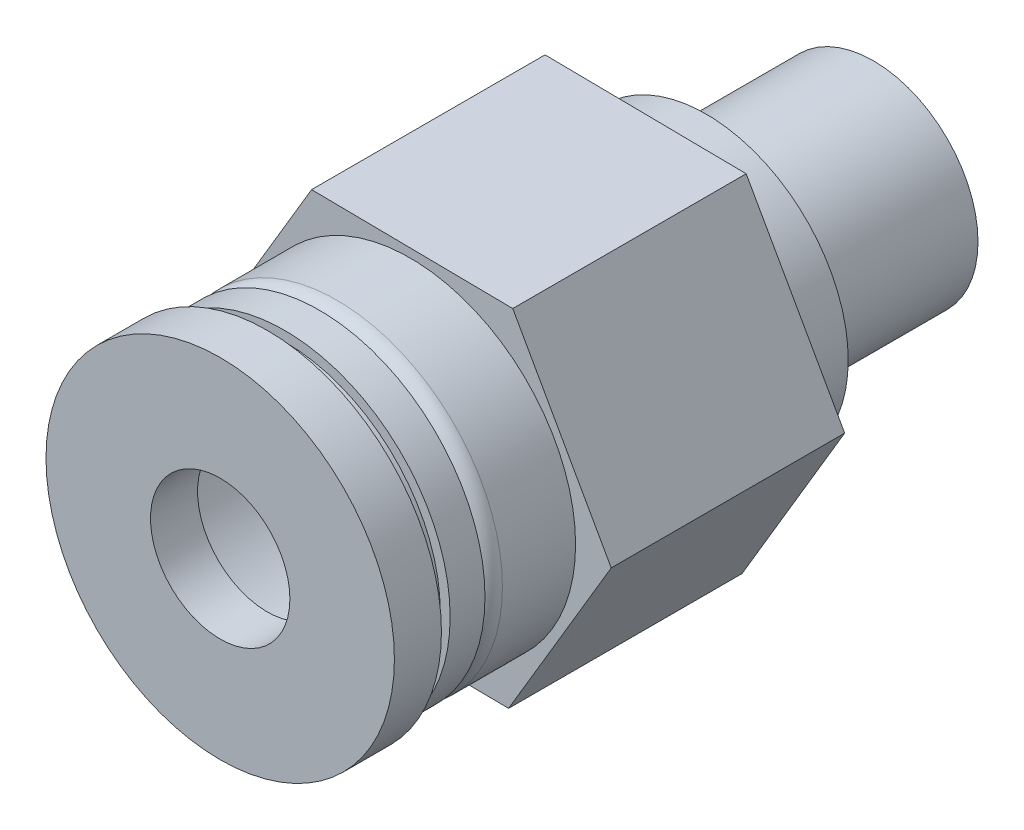
ISO-10303-21;
HEADER;
FILE_DESCRIPTION(('STEP AP214'),'2;1');
FILE_NAME('part.step','',(''),(''),'','','');
FILE_SCHEMA(('AUTOMOTIVE_DESIGN { 1 0 10303 214 1 1 1 1 }'));
ENDSEC;
DATA;
#1=APPLICATION_CONTEXT('core data for automotive mechanical design processes');
#2=APPLICATION_PROTOCOL_DEFINITION('international standard','automotive_design',2000,#1);
#3=PRODUCT_CONTEXT('',#1,'mechanical');
#4=PRODUCT('Part','Part','',(#3));
#5=PRODUCT_RELATED_PRODUCT_CATEGORY('part','',(#4));
#6=PRODUCT_DEFINITION_FORMATION('','',#4);
#7=PRODUCT_DEFINITION_CONTEXT('part definition',#1,'design');
#8=PRODUCT_DEFINITION('design','',#6,#7);
#9=PRODUCT_DEFINITION_SHAPE('','',#8);
#10=(LENGTH_UNIT() NAMED_UNIT(*) SI_UNIT(.MILLI.,.METRE.));
#11=(NAMED_UNIT(*) PLANE_ANGLE_UNIT() SI_UNIT($,.RADIAN.));
#12=(NAMED_UNIT(*) SI_UNIT($,.STERADIAN.) SOLID_ANGLE_UNIT());
#13=UNCERTAINTY_MEASURE_WITH_UNIT(LENGTH_MEASURE(1.E-05),#10,'distance_accuracy_value','');
#14=(GEOMETRIC_REPRESENTATION_CONTEXT(3) GLOBAL_UNCERTAINTY_ASSIGNED_CONTEXT((#13)) GLOBAL_UNIT_ASSIGNED_CONTEXT((#10,
#11,#12)) REPRESENTATION_CONTEXT('',''));
#15=CARTESIAN_POINT('',(0.,0.,0.));
#16=DIRECTION('',(0.,0.,1.));
#17=DIRECTION('',(1.,0.,0.));
#18=AXIS2_PLACEMENT_3D('',#15,#16,#17);
#19=CARTESIAN_POINT('',(0.,0.,17.));
#20=DIRECTION('',(0.,0.,1.));
#21=DIRECTION('',(1.,0.,0.));
#22=AXIS2_PLACEMENT_3D('',#19,#20,#21);
#23=PLANE('',#22);
#24=CARTESIAN_POINT('',(0.,0.,17.));
#25=DIRECTION('',(0.,0.,1.));
#26=DIRECTION('',(1.,0.,0.));
#27=AXIS2_PLACEMENT_3D('',#24,#25,#26);
#28=CIRCLE('',#27,4.46573097871401);
#29=CARTESIAN_POINT('',(4.46573097871401,0.,17.));
#30=VERTEX_POINT('',#29);
#31=EDGE_CURVE('E52',#30,#30,#28,.T.);
#32=ORIENTED_EDGE('',*,*,#31,.F.);
#33=EDGE_LOOP('',(#32));
#34=FACE_BOUND('',#33,.T.);
#35=CARTESIAN_POINT('',(0.,0.,17.));
#36=DIRECTION('',(0.,0.,1.));
#37=DIRECTION('',(1.,0.,0.));
#38=AXIS2_PLACEMENT_3D('',#35,#36,#37);
#39=CIRCLE('',#38,4.17701490620842);
#40=CARTESIAN_POINT('',(4.17701490620842,0.,17.));
#41=VERTEX_POINT('',#40);
#42=EDGE_CURVE('E59',#41,#41,#39,.T.);
#43=ORIENTED_EDGE('',*,*,#42,.T.);
#44=EDGE_LOOP('',(#43));
#45=FACE_BOUND('',#44,.T.);
#46=ADVANCED_FACE('F48',(#34,#45),#23,.F.);
#47=CARTESIAN_POINT('',(0.,0.,17.5));
#48=DIRECTION('',(0.,0.,-1.));
#49=DIRECTION('',(-1.,0.,0.));
#50=AXIS2_PLACEMENT_3D('',#47,#48,#49);
#51=CYLINDRICAL_SURFACE('',#50,4.46573097871401);
#52=CARTESIAN_POINT('',(0.,0.,17.5));
#53=DIRECTION('',(0.,0.,1.));
#54=DIRECTION('',(1.,0.,0.));
#55=AXIS2_PLACEMENT_3D('',#52,#53,#54);
#56=CIRCLE('',#55,4.46573097871401);
#57=CARTESIAN_POINT('',(4.46573097871401,0.,17.5));
#58=VERTEX_POINT('',#57);
#59=EDGE_CURVE('E11',#58,#58,#56,.T.);
#60=ORIENTED_EDGE('',*,*,#59,.F.);
#61=EDGE_LOOP('',(#60));
#62=FACE_BOUND('',#61,.T.);
#63=ORIENTED_EDGE('',*,*,#31,.T.);
#64=EDGE_LOOP('',(#63));
#65=FACE_BOUND('',#64,.T.);
#66=ADVANCED_FACE('F50',(#62,#65),#51,.T.);
#67=CARTESIAN_POINT('',(0.,0.,17.5));
#68=DIRECTION('',(0.,0.,-1.));
#69=DIRECTION('',(-1.,0.,0.));
#70=AXIS2_PLACEMENT_3D('',#67,#68,#69);
#71=CYLINDRICAL_SURFACE('',#70,4.17701490620842);
#72=CARTESIAN_POINT('',(0.,0.,17.5));
#73=DIRECTION('',(0.,0.,1.));
#74=DIRECTION('',(1.,0.,0.));
#75=AXIS2_PLACEMENT_3D('',#72,#73,#74);
#76=CIRCLE('',#75,4.17701490620842);
#77=CARTESIAN_POINT('',(4.17701490620842,0.,17.5));
#78=VERTEX_POINT('',#77);
#79=EDGE_CURVE('E63',#78,#78,#76,.T.);
#80=ORIENTED_EDGE('',*,*,#79,.T.);
#81=EDGE_LOOP('',(#80));
#82=FACE_BOUND('',#81,.T.);
#83=ORIENTED_EDGE('',*,*,#42,.F.);
#84=EDGE_LOOP('',(#83));
#85=FACE_BOUND('',#84,.T.);
#86=ADVANCED_FACE('F95',(#82,#85),#71,.F.);
#87=CARTESIAN_POINT('',(0.,0.,17.5));
#88=DIRECTION('',(0.,0.,1.));
#89=DIRECTION('',(1.,0.,0.));
#90=AXIS2_PLACEMENT_3D('',#87,#88,#89);
#91=PLANE('',#90);
#92=CARTESIAN_POINT('',(0.,0.,17.5));
#93=DIRECTION('',(0.,0.,1.));
#94=DIRECTION('',(1.,0.,0.));
#95=AXIS2_PLACEMENT_3D('',#92,#93,#94);
#96=CIRCLE('',#95,5.);
#97=CARTESIAN_POINT('',(5.,0.,17.5));
#98=VERTEX_POINT('',#97);
#99=EDGE_CURVE('E67',#98,#98,#96,.T.);
#100=ORIENTED_EDGE('',*,*,#99,.F.);
#101=EDGE_LOOP('',(#100));
#102=FACE_BOUND('',#101,.T.);
#103=ORIENTED_EDGE('',*,*,#59,.T.);
#104=EDGE_LOOP('',(#103));
#105=FACE_BOUND('',#104,.T.);
#106=ADVANCED_FACE('F85',(#102,#105),#91,.F.);
#107=CARTESIAN_POINT('',(0.,0.,18.85));
#108=DIRECTION('',(0.,0.,1.));
#109=DIRECTION('',(1.,0.,0.));
#110=AXIS2_PLACEMENT_3D('',#107,#108,#109);
#111=PLANE('',#110);
#112=CARTESIAN_POINT('',(0.,0.,18.85));
#113=DIRECTION('',(0.,0.,1.));
#114=DIRECTION('',(1.,0.,0.));
#115=AXIS2_PLACEMENT_3D('',#112,#113,#114);
#116=CIRCLE('',#115,5.);
#117=CARTESIAN_POINT('',(5.,0.,18.85));
#118=VERTEX_POINT('',#117);
#119=EDGE_CURVE('E66',#118,#118,#116,.T.);
#120=ORIENTED_EDGE('',*,*,#119,.T.);
#121=EDGE_LOOP('',(#120));
#122=FACE_BOUND('',#121,.T.);
#123=CARTESIAN_POINT('',(0.,0.,18.85));
#124=DIRECTION('',(0.,0.,1.));
#125=DIRECTION('',(1.,0.,0.));
#126=AXIS2_PLACEMENT_3D('',#123,#124,#125);
#127=CIRCLE('',#126,2.);
#128=CARTESIAN_POINT('',(2.,0.,18.85));
#129=VERTEX_POINT('',#128);
#130=EDGE_CURVE('E70',#129,#129,#127,.T.);
#131=ORIENTED_EDGE('',*,*,#130,.F.);
#132=EDGE_LOOP('',(#131));
#133=FACE_BOUND('',#132,.T.);
#134=ADVANCED_FACE('F82',(#122,#133),#111,.T.);
#135=ORIENTED_EDGE('',*,*,#79,.F.);
#136=EDGE_LOOP('',(#135));
#137=FACE_BOUND('',#136,.T.);
#138=CARTESIAN_POINT('',(0.,0.,17.5));
#139=DIRECTION('',(0.,0.,1.));
#140=DIRECTION('',(1.,0.,0.));
#141=AXIS2_PLACEMENT_3D('',#138,#139,#140);
#142=CIRCLE('',#141,2.);
#143=CARTESIAN_POINT('',(2.,0.,17.5));
#144=VERTEX_POINT('',#143);
#145=EDGE_CURVE('E73',#144,#144,#142,.T.);
#146=ORIENTED_EDGE('',*,*,#145,.T.);
#147=EDGE_LOOP('',(#146));
#148=FACE_BOUND('',#147,.T.);
#149=ADVANCED_FACE('F84',(#137,#148),#91,.F.);
#150=CARTESIAN_POINT('',(0.,0.,18.85));
#151=DIRECTION('',(0.,0.,-1.));
#152=DIRECTION('',(-1.,0.,0.));
#153=AXIS2_PLACEMENT_3D('',#150,#151,#152);
#154=CYLINDRICAL_SURFACE('',#153,5.);
#155=ORIENTED_EDGE('',*,*,#119,.F.);
#156=EDGE_LOOP('',(#155));
#157=FACE_BOUND('',#156,.T.);
#158=ORIENTED_EDGE('',*,*,#99,.T.);
#159=EDGE_LOOP('',(#158));
#160=FACE_BOUND('',#159,.T.);
#161=ADVANCED_FACE('F92',(#157,#160),#154,.T.);
#162=CARTESIAN_POINT('',(0.,0.,18.85));
#163=DIRECTION('',(0.,0.,-1.));
#164=DIRECTION('',(-1.,0.,0.));
#165=AXIS2_PLACEMENT_3D('',#162,#163,#164);
#166=CYLINDRICAL_SURFACE('',#165,2.);
#167=ORIENTED_EDGE('',*,*,#130,.T.);
#168=EDGE_LOOP('',(#167));
#169=FACE_BOUND('',#168,.T.);
#170=ORIENTED_EDGE('',*,*,#145,.F.);
#171=EDGE_LOOP('',(#170));
#172=FACE_BOUND('',#171,.T.);
#173=ADVANCED_FACE('F79',(#169,#172),#166,.F.);
#174=CLOSED_SHELL('',(#46,#66,#86,#106,#134,#149,#161,#173));
#175=MANIFOLD_SOLID_BREP('B2',#174);
#176=CARTESIAN_POINT('',(0.,0.,6.7));
#177=DIRECTION('',(0.,0.,1.));
#178=DIRECTION('',(1.,0.,0.));
#179=AXIS2_PLACEMENT_3D('',#176,#177,#178);
#180=PLANE('',#179);
#181=CARTESIAN_POINT('',(0.,0.,6.7));
#182=DIRECTION('',(0.,0.,1.));
#183=DIRECTION('',(1.,0.,0.));
#184=AXIS2_PLACEMENT_3D('',#181,#182,#183);
#185=CIRCLE('',#184,2.15);
#186=CARTESIAN_POINT('',(2.15,0.,6.7));
#187=VERTEX_POINT('',#186);
#188=EDGE_CURVE('E297',#187,#187,#185,.T.);
#189=ORIENTED_EDGE('',*,*,#188,.F.);
#190=EDGE_LOOP('',(#189));
#191=FACE_BOUND('',#190,.T.);
#192=CARTESIAN_POINT('',(0.,0.,6.7));
#193=DIRECTION('',(0.,0.,1.));
#194=DIRECTION('',(1.,0.,0.));
#195=AXIS2_PLACEMENT_3D('',#192,#193,#194);
#196=CIRCLE('',#195,3.);
#197=CARTESIAN_POINT('',(3.,0.,6.7));
#198=VERTEX_POINT('',#197);
#199=EDGE_CURVE('E46',#198,#198,#196,.F.);
#200=ORIENTED_EDGE('',*,*,#199,.F.);
#201=EDGE_LOOP('',(#200));
#202=FACE_BOUND('',#201,.T.);
#203=ADVANCED_FACE('F169',(#191,#202),#180,.T.);
#204=CARTESIAN_POINT('',(0.,0.,6.7));
#205=DIRECTION('',(0.,0.,-1.));
#206=DIRECTION('',(-1.,0.,0.));
#207=AXIS2_PLACEMENT_3D('',#204,#205,#206);
#208=CYLINDRICAL_SURFACE('',#207,3.);
#209=CARTESIAN_POINT('',(0.,0.,4.9));
#210=DIRECTION('',(0.,0.,-1.));
#211=DIRECTION('',(-1.,0.,0.));
#212=AXIS2_PLACEMENT_3D('',#209,#210,#211);
#213=CIRCLE('',#212,3.);
#214=CARTESIAN_POINT('',(-3.,0.,4.9));
#215=VERTEX_POINT('',#214);
#216=EDGE_CURVE('E288',#215,#215,#213,.T.);
#217=ORIENTED_EDGE('',*,*,#216,.T.);
#218=EDGE_LOOP('',(#217));
#219=FACE_BOUND('',#218,.T.);
#220=CARTESIAN_POINT('',(0.,0.,0.1));
#221=DIRECTION('',(0.,0.,-1.));
#222=DIRECTION('',(-1.,0.,0.));
#223=AXIS2_PLACEMENT_3D('',#220,#221,#222);
#224=CIRCLE('',#223,3.);
#225=CARTESIAN_POINT('',(-3.,0.,0.1));
#226=VERTEX_POINT('',#225);
#227=EDGE_CURVE('E178',#226,#226,#224,.T.);
#228=ORIENTED_EDGE('',*,*,#227,.F.);
#229=EDGE_LOOP('',(#228));
#230=FACE_BOUND('',#229,.T.);
#231=ADVANCED_FACE('F171',(#219,#230),#208,.T.);
#232=CARTESIAN_POINT('',(0.,0.,0.1));
#233=DIRECTION('',(0.,0.,-1.));
#234=DIRECTION('',(-1.,0.,0.));
#235=AXIS2_PLACEMENT_3D('',#232,#233,#234);
#236=PLANE('',#235);
#237=CARTESIAN_POINT('',(0.,0.,0.1));
#238=DIRECTION('',(0.,0.,-1.));
#239=DIRECTION('',(-1.,0.,0.));
#240=AXIS2_PLACEMENT_3D('',#237,#238,#239);
#241=CIRCLE('',#240,2.15);
#242=CARTESIAN_POINT('',(-2.15,0.,0.1));
#243=VERTEX_POINT('',#242);
#244=EDGE_CURVE('E294',#243,#243,#241,.T.);
#245=ORIENTED_EDGE('',*,*,#244,.F.);
#246=EDGE_LOOP('',(#245));
#247=FACE_BOUND('',#246,.T.);
#248=ORIENTED_EDGE('',*,*,#227,.T.);
#249=EDGE_LOOP('',(#248));
#250=FACE_BOUND('',#249,.T.);
#251=ADVANCED_FACE('F302',(#247,#250),#236,.T.);
#252=CARTESIAN_POINT('',(0.,0.,12.7));
#253=DIRECTION('',(0.,0.,-1.));
#254=DIRECTION('',(-1.,0.,0.));
#255=AXIS2_PLACEMENT_3D('',#252,#253,#254);
#256=CYLINDRICAL_SURFACE('',#255,2.15);
#257=ORIENTED_EDGE('',*,*,#188,.T.);
#258=EDGE_LOOP('',(#257));
#259=FACE_BOUND('',#258,.T.);
#260=ORIENTED_EDGE('',*,*,#244,.T.);
#261=EDGE_LOOP('',(#260));
#262=FACE_BOUND('',#261,.T.);
#263=ADVANCED_FACE('F310',(#259,#262),#256,.F.);
#264=CARTESIAN_POINT('',(0.,0.,4.9));
#265=DIRECTION('',(0.,0.,-1.));
#266=DIRECTION('',(-1.,0.,0.));
#267=AXIS2_PLACEMENT_3D('',#264,#265,#266);
#268=PLANE('',#267);
#269=CARTESIAN_POINT('',(0.,0.,4.9));
#270=DIRECTION('',(0.,0.,-1.));
#271=DIRECTION('',(-1.,0.,0.));
#272=AXIS2_PLACEMENT_3D('',#269,#270,#271);
#273=CIRCLE('',#272,4.075);
#274=CARTESIAN_POINT('',(-4.075,0.,4.9));
#275=VERTEX_POINT('',#274);
#276=EDGE_CURVE('E291',#275,#275,#273,.T.);
#277=ORIENTED_EDGE('',*,*,#276,.T.);
#278=EDGE_LOOP('',(#277));
#279=FACE_BOUND('',#278,.T.);
#280=ORIENTED_EDGE('',*,*,#216,.F.);
#281=EDGE_LOOP('',(#280));
#282=FACE_BOUND('',#281,.T.);
#283=ADVANCED_FACE('F317',(#279,#282),#268,.T.);
#284=CARTESIAN_POINT('',(0.,0.,4.9));
#285=DIRECTION('',(0.,0.,1.));
#286=DIRECTION('',(1.,0.,0.));
#287=AXIS2_PLACEMENT_3D('',#284,#285,#286);
#288=CYLINDRICAL_SURFACE('',#287,4.075);
#289=ORIENTED_EDGE('',*,*,#276,.F.);
#290=EDGE_LOOP('',(#289));
#291=FACE_BOUND('',#290,.T.);
#292=CARTESIAN_POINT('',(0.,0.,6.7));
#293=DIRECTION('',(0.,0.,1.));
#294=DIRECTION('',(1.,0.,0.));
#295=AXIS2_PLACEMENT_3D('',#292,#293,#294);
#296=CIRCLE('',#295,4.075);
#297=CARTESIAN_POINT('',(4.075,0.,6.7));
#298=VERTEX_POINT('',#297);
#299=EDGE_CURVE('E285',#298,#298,#296,.T.);
#300=ORIENTED_EDGE('',*,*,#299,.F.);
#301=EDGE_LOOP('',(#300));
#302=FACE_BOUND('',#301,.T.);
#303=ADVANCED_FACE('F319',(#291,#302),#288,.T.);
#304=CARTESIAN_POINT('',(0.,0.,13.4));
#305=DIRECTION('',(0.,0.,1.));
#306=DIRECTION('',(1.,0.,0.));
#307=AXIS2_PLACEMENT_3D('',#304,#305,#306);
#308=PLANE('',#307);
#309=DIRECTION('',(0.999928814042504,-0.0119317579405014,0.));
#310=VECTOR('',#309,1.);
#311=CARTESIAN_POINT('',(-2.94620463949202,-4.96520005191825,13.4));
#312=LINE('',#311,#310);
#313=CARTESIAN_POINT('',(-2.94620463949202,-4.96520005191825,13.4));
#314=VERTEX_POINT('',#313);
#315=CARTESIAN_POINT('',(2.82688706008701,-5.03408808850679,13.4));
#316=VERTEX_POINT('',#315);
#317=EDGE_CURVE('E267',#314,#316,#312,.T.);
#318=ORIENTED_EDGE('',*,*,#317,.T.);
#319=DIRECTION('',(0.510297612509533,0.859997875966604,0.));
#320=VECTOR('',#319,1.);
#321=CARTESIAN_POINT('',(2.82688706008701,-5.03408808850679,13.4));
#322=LINE('',#321,#320);
#323=CARTESIAN_POINT('',(5.77309169957903,-0.0688880365885399,13.4));
#324=VERTEX_POINT('',#323);
#325=EDGE_CURVE('E224',#316,#324,#322,.T.);
#326=ORIENTED_EDGE('',*,*,#325,.T.);
#327=DIRECTION('',(-0.489631201532972,0.871929633907105,0.));
#328=VECTOR('',#327,1.);
#329=CARTESIAN_POINT('',(5.77309169957903,-0.0688880365885399,13.4));
#330=LINE('',#329,#328);
#331=CARTESIAN_POINT('',(2.94620463949202,4.96520005191825,13.4));
#332=VERTEX_POINT('',#331);
#333=EDGE_CURVE('E238',#324,#332,#330,.T.);
#334=ORIENTED_EDGE('',*,*,#333,.T.);
#335=DIRECTION('',(-0.999928814042504,0.0119317579405012,0.));
#336=VECTOR('',#335,1.);
#337=CARTESIAN_POINT('',(2.94620463949202,4.96520005191825,13.4));
#338=LINE('',#337,#336);
#339=CARTESIAN_POINT('',(-2.82688706008701,5.03408808850679,13.4));
#340=VERTEX_POINT('',#339);
#341=EDGE_CURVE('E231',#332,#340,#338,.T.);
#342=ORIENTED_EDGE('',*,*,#341,.T.);
#343=DIRECTION('',(-0.510297612509533,-0.859997875966604,0.));
#344=VECTOR('',#343,1.);
#345=CARTESIAN_POINT('',(-2.82688706008701,5.03408808850679,13.4));
#346=LINE('',#345,#344);
#347=CARTESIAN_POINT('',(-5.77309169957903,0.0688880365885399,13.4));
#348=VERTEX_POINT('',#347);
#349=EDGE_CURVE('E236',#340,#348,#346,.T.);
#350=ORIENTED_EDGE('',*,*,#349,.T.);
#351=DIRECTION('',(0.489631201532971,-0.871929633907105,0.));
#352=VECTOR('',#351,1.);
#353=CARTESIAN_POINT('',(-5.77309169957903,0.0688880365885399,13.4));
#354=LINE('',#353,#352);
#355=EDGE_CURVE('E186',#348,#314,#354,.T.);
#356=ORIENTED_EDGE('',*,*,#355,.T.);
#357=EDGE_LOOP('',(#318,#326,#334,#342,#350,#356));
#358=FACE_BOUND('',#357,.T.);
#359=CARTESIAN_POINT('',(0.,0.,13.4));
#360=DIRECTION('',(0.,0.,1.));
#361=DIRECTION('',(1.,0.,0.));
#362=AXIS2_PLACEMENT_3D('',#359,#360,#361);
#363=CIRCLE('',#362,4.75);
#364=CARTESIAN_POINT('',(4.75,0.,13.4));
#365=VERTEX_POINT('',#364);
#366=EDGE_CURVE('E399',#365,#365,#363,.T.);
#367=ORIENTED_EDGE('',*,*,#366,.F.);
#368=EDGE_LOOP('',(#367));
#369=FACE_BOUND('',#368,.T.);
#370=ADVANCED_FACE('F233',(#358,#369),#308,.T.);
#371=CARTESIAN_POINT('',(0.,0.,13.4));
#372=DIRECTION('',(0.,0.,1.));
#373=DIRECTION('',(1.,0.,0.));
#374=AXIS2_PLACEMENT_3D('',#371,#372,#373);
#375=CIRCLE('',#374,3.75);
#376=CARTESIAN_POINT('',(3.75,0.,13.4));
#377=VERTEX_POINT('',#376);
#378=EDGE_CURVE('E276',#377,#377,#375,.F.);
#379=ORIENTED_EDGE('',*,*,#378,.F.);
#380=EDGE_LOOP('',(#379));
#381=FACE_BOUND('',#380,.T.);
#382=CARTESIAN_POINT('',(0.,0.,13.4));
#383=DIRECTION('',(0.,0.,1.));
#384=DIRECTION('',(1.,0.,0.));
#385=AXIS2_PLACEMENT_3D('',#382,#383,#384);
#386=CIRCLE('',#385,3.);
#387=CARTESIAN_POINT('',(3.,0.,13.4));
#388=VERTEX_POINT('',#387);
#389=EDGE_CURVE('E260',#388,#388,#386,.T.);
#390=ORIENTED_EDGE('',*,*,#389,.F.);
#391=EDGE_LOOP('',(#390));
#392=FACE_BOUND('',#391,.T.);
#393=ADVANCED_FACE('F359',(#381,#392),#308,.T.);
#394=CARTESIAN_POINT('',(0.,0.,6.7));
#395=DIRECTION('',(0.,0.,1.));
#396=DIRECTION('',(1.,0.,0.));
#397=AXIS2_PLACEMENT_3D('',#394,#395,#396);
#398=PLANE('',#397);
#399=ORIENTED_EDGE('',*,*,#299,.T.);
#400=EDGE_LOOP('',(#399));
#401=FACE_BOUND('',#400,.T.);
#402=DIRECTION('',(0.999928814042504,-0.0119317579405014,0.));
#403=VECTOR('',#402,1.);
#404=CARTESIAN_POINT('',(-2.94620463949202,-4.96520005191825,6.7));
#405=LINE('',#404,#403);
#406=CARTESIAN_POINT('',(-2.94620463949202,-4.96520005191825,6.7));
#407=VERTEX_POINT('',#406);
#408=CARTESIAN_POINT('',(2.82688706008701,-5.03408808850679,6.7));
#409=VERTEX_POINT('',#408);
#410=EDGE_CURVE('E256',#407,#409,#405,.T.);
#411=ORIENTED_EDGE('',*,*,#410,.F.);
#412=DIRECTION('',(0.489631201532971,-0.871929633907105,0.));
#413=VECTOR('',#412,1.);
#414=CARTESIAN_POINT('',(-5.77309169957903,0.0688880365885399,6.7));
#415=LINE('',#414,#413);
#416=CARTESIAN_POINT('',(-5.77309169957903,0.0688880365885399,6.7));
#417=VERTEX_POINT('',#416);
#418=EDGE_CURVE('E215',#417,#407,#415,.T.);
#419=ORIENTED_EDGE('',*,*,#418,.F.);
#420=DIRECTION('',(-0.510297612509533,-0.859997875966604,0.));
#421=VECTOR('',#420,1.);
#422=CARTESIAN_POINT('',(-2.82688706008701,5.03408808850679,6.7));
#423=LINE('',#422,#421);
#424=CARTESIAN_POINT('',(-2.82688706008701,5.03408808850679,6.7));
#425=VERTEX_POINT('',#424);
#426=EDGE_CURVE('E209',#425,#417,#423,.T.);
#427=ORIENTED_EDGE('',*,*,#426,.F.);
#428=DIRECTION('',(-0.999928814042504,0.0119317579405012,0.));
#429=VECTOR('',#428,1.);
#430=CARTESIAN_POINT('',(2.94620463949202,4.96520005191825,6.7));
#431=LINE('',#430,#429);
#432=CARTESIAN_POINT('',(2.94620463949202,4.96520005191825,6.7));
#433=VERTEX_POINT('',#432);
#434=EDGE_CURVE('E246',#433,#425,#431,.T.);
#435=ORIENTED_EDGE('',*,*,#434,.F.);
#436=DIRECTION('',(-0.489631201532972,0.871929633907105,0.));
#437=VECTOR('',#436,1.);
#438=CARTESIAN_POINT('',(5.77309169957903,-0.0688880365885399,6.7));
#439=LINE('',#438,#437);
#440=CARTESIAN_POINT('',(5.77309169957903,-0.0688880365885399,6.7));
#441=VERTEX_POINT('',#440);
#442=EDGE_CURVE('E262',#441,#433,#439,.T.);
#443=ORIENTED_EDGE('',*,*,#442,.F.);
#444=DIRECTION('',(0.510297612509533,0.859997875966604,0.));
#445=VECTOR('',#444,1.);
#446=CARTESIAN_POINT('',(2.82688706008701,-5.03408808850679,6.7));
#447=LINE('',#446,#445);
#448=EDGE_CURVE('E259',#409,#441,#447,.T.);
#449=ORIENTED_EDGE('',*,*,#448,.F.);
#450=EDGE_LOOP('',(#411,#419,#427,#435,#443,#449));
#451=FACE_BOUND('',#450,.T.);
#452=ADVANCED_FACE('F341',(#401,#451),#398,.F.);
#453=CARTESIAN_POINT('',(-2.94620463949202,-4.96520005191825,13.4));
#454=DIRECTION('',(0.0119317579405014,0.999928814042505,0.));
#455=DIRECTION('',(-0.999928814042504,0.0119317579405013,0.));
#456=AXIS2_PLACEMENT_3D('',#453,#454,#455);
#457=PLANE('',#456);
#458=ORIENTED_EDGE('',*,*,#410,.T.);
#459=DIRECTION('',(0.,0.,-1.));
#460=VECTOR('',#459,1.);
#461=CARTESIAN_POINT('',(2.82688706008701,-5.03408808850679,13.4));
#462=LINE('',#461,#460);
#463=EDGE_CURVE('E274',#316,#409,#462,.T.);
#464=ORIENTED_EDGE('',*,*,#463,.F.);
#465=ORIENTED_EDGE('',*,*,#317,.F.);
#466=DIRECTION('',(0.,0.,-1.));
#467=VECTOR('',#466,1.);
#468=CARTESIAN_POINT('',(-2.94620463949202,-4.96520005191825,13.4));
#469=LINE('',#468,#467);
#470=EDGE_CURVE('E252',#314,#407,#469,.T.);
#471=ORIENTED_EDGE('',*,*,#470,.T.);
#472=EDGE_LOOP('',(#458,#464,#465,#471));
#473=FACE_BOUND('',#472,.T.);
#474=ADVANCED_FACE('F337',(#473),#457,.F.);
#475=CARTESIAN_POINT('',(2.82688706008701,-5.03408808850679,13.4));
#476=DIRECTION('',(-0.859997875966604,0.510297612509533,0.));
#477=DIRECTION('',(-0.510297612509533,-0.859997875966604,0.));
#478=AXIS2_PLACEMENT_3D('',#475,#476,#477);
#479=PLANE('',#478);
#480=ORIENTED_EDGE('',*,*,#448,.T.);
#481=DIRECTION('',(0.,0.,-1.));
#482=VECTOR('',#481,1.);
#483=CARTESIAN_POINT('',(5.77309169957903,-0.0688880365885399,13.4));
#484=LINE('',#483,#482);
#485=EDGE_CURVE('E271',#324,#441,#484,.T.);
#486=ORIENTED_EDGE('',*,*,#485,.F.);
#487=ORIENTED_EDGE('',*,*,#325,.F.);
#488=ORIENTED_EDGE('',*,*,#463,.T.);
#489=EDGE_LOOP('',(#480,#486,#487,#488));
#490=FACE_BOUND('',#489,.T.);
#491=ADVANCED_FACE('F340',(#490),#479,.F.);
#492=CARTESIAN_POINT('',(5.77309169957903,-0.0688880365885399,13.4));
#493=DIRECTION('',(-0.871929633907105,-0.489631201532972,0.));
#494=DIRECTION('',(0.489631201532972,-0.871929633907105,0.));
#495=AXIS2_PLACEMENT_3D('',#492,#493,#494);
#496=PLANE('',#495);
#497=ORIENTED_EDGE('',*,*,#442,.T.);
#498=DIRECTION('',(0.,0.,-1.));
#499=VECTOR('',#498,1.);
#500=CARTESIAN_POINT('',(2.94620463949202,4.96520005191825,13.4));
#501=LINE('',#500,#499);
#502=EDGE_CURVE('E247',#332,#433,#501,.T.);
#503=ORIENTED_EDGE('',*,*,#502,.F.);
#504=ORIENTED_EDGE('',*,*,#333,.F.);
#505=ORIENTED_EDGE('',*,*,#485,.T.);
#506=EDGE_LOOP('',(#497,#503,#504,#505));
#507=FACE_BOUND('',#506,.T.);
#508=ADVANCED_FACE('F345',(#507),#496,.F.);
#509=CARTESIAN_POINT('',(2.94620463949202,4.96520005191825,13.4));
#510=DIRECTION('',(-0.0119317579405012,-0.999928814042504,0.));
#511=DIRECTION('',(0.999928814042504,-0.0119317579405012,0.));
#512=AXIS2_PLACEMENT_3D('',#509,#510,#511);
#513=PLANE('',#512);
#514=ORIENTED_EDGE('',*,*,#434,.T.);
#515=DIRECTION('',(0.,0.,-1.));
#516=VECTOR('',#515,1.);
#517=CARTESIAN_POINT('',(-2.82688706008701,5.03408808850679,13.4));
#518=LINE('',#517,#516);
#519=EDGE_CURVE('E243',#340,#425,#518,.T.);
#520=ORIENTED_EDGE('',*,*,#519,.F.);
#521=ORIENTED_EDGE('',*,*,#341,.F.);
#522=ORIENTED_EDGE('',*,*,#502,.T.);
#523=EDGE_LOOP('',(#514,#520,#521,#522));
#524=FACE_BOUND('',#523,.T.);
#525=ADVANCED_FACE('F244',(#524),#513,.F.);
#526=CARTESIAN_POINT('',(-2.82688706008701,5.03408808850679,13.4));
#527=DIRECTION('',(0.859997875966604,-0.510297612509533,0.));
#528=DIRECTION('',(0.510297612509533,0.859997875966604,0.));
#529=AXIS2_PLACEMENT_3D('',#526,#527,#528);
#530=PLANE('',#529);
#531=ORIENTED_EDGE('',*,*,#426,.T.);
#532=DIRECTION('',(0.,0.,-1.));
#533=VECTOR('',#532,1.);
#534=CARTESIAN_POINT('',(-5.77309169957903,0.0688880365885399,13.4));
#535=LINE('',#534,#533);
#536=EDGE_CURVE('E248',#348,#417,#535,.T.);
#537=ORIENTED_EDGE('',*,*,#536,.F.);
#538=ORIENTED_EDGE('',*,*,#349,.F.);
#539=ORIENTED_EDGE('',*,*,#519,.T.);
#540=EDGE_LOOP('',(#531,#537,#538,#539));
#541=FACE_BOUND('',#540,.T.);
#542=ADVANCED_FACE('F250',(#541),#530,.F.);
#543=CARTESIAN_POINT('',(-5.77309169957903,0.0688880365885399,13.4));
#544=DIRECTION('',(0.871929633907105,0.489631201532971,0.));
#545=DIRECTION('',(-0.489631201532971,0.871929633907105,0.));
#546=AXIS2_PLACEMENT_3D('',#543,#544,#545);
#547=PLANE('',#546);
#548=ORIENTED_EDGE('',*,*,#418,.T.);
#549=ORIENTED_EDGE('',*,*,#470,.F.);
#550=ORIENTED_EDGE('',*,*,#355,.F.);
#551=ORIENTED_EDGE('',*,*,#536,.T.);
#552=EDGE_LOOP('',(#548,#549,#550,#551));
#553=FACE_BOUND('',#552,.T.);
#554=ADVANCED_FACE('F353',(#553),#547,.F.);
#555=CARTESIAN_POINT('',(0.,0.,13.4));
#556=DIRECTION('',(0.,0.,-1.));
#557=DIRECTION('',(-1.,0.,0.));
#558=AXIS2_PLACEMENT_3D('',#555,#556,#557);
#559=CYLINDRICAL_SURFACE('',#558,3.);
#560=ORIENTED_EDGE('',*,*,#389,.T.);
#561=EDGE_LOOP('',(#560));
#562=FACE_BOUND('',#561,.T.);
#563=ORIENTED_EDGE('',*,*,#199,.T.);
#564=EDGE_LOOP('',(#563));
#565=FACE_BOUND('',#564,.T.);
#566=ADVANCED_FACE('F356',(#562,#565),#559,.F.);
#567=CARTESIAN_POINT('',(0.,0.,16.));
#568=DIRECTION('',(0.,0.,-1.));
#569=DIRECTION('',(-1.,0.,0.));
#570=AXIS2_PLACEMENT_3D('',#567,#568,#569);
#571=CYLINDRICAL_SURFACE('',#570,4.75);
#572=CARTESIAN_POINT('',(0.,0.,15.5));
#573=DIRECTION('',(0.,0.,1.));
#574=DIRECTION('',(1.,0.,0.));
#575=AXIS2_PLACEMENT_3D('',#572,#573,#574);
#576=CIRCLE('',#575,4.75);
#577=CARTESIAN_POINT('',(4.75,0.,15.5));
#578=VERTEX_POINT('',#577);
#579=EDGE_CURVE('E282',#578,#578,#576,.F.);
#580=ORIENTED_EDGE('',*,*,#579,.T.);
#581=EDGE_LOOP('',(#580));
#582=FACE_BOUND('',#581,.T.);
#583=ORIENTED_EDGE('',*,*,#366,.T.);
#584=EDGE_LOOP('',(#583));
#585=FACE_BOUND('',#584,.T.);
#586=ADVANCED_FACE('F366',(#582,#585),#571,.T.);
#587=CARTESIAN_POINT('',(0.,0.,16.));
#588=DIRECTION('',(0.,0.,-1.));
#589=DIRECTION('',(-1.,0.,0.));
#590=AXIS2_PLACEMENT_3D('',#587,#588,#589);
#591=CYLINDRICAL_SURFACE('',#590,3.75);
#592=ORIENTED_EDGE('',*,*,#378,.T.);
#593=EDGE_LOOP('',(#592));
#594=FACE_BOUND('',#593,.T.);
#595=CARTESIAN_POINT('',(0.,0.,17.));
#596=DIRECTION('',(0.,0.,1.));
#597=DIRECTION('',(1.,0.,0.));
#598=AXIS2_PLACEMENT_3D('',#595,#596,#597);
#599=CIRCLE('',#598,3.75);
#600=CARTESIAN_POINT('',(3.75,0.,17.));
#601=VERTEX_POINT('',#600);
#602=EDGE_CURVE('E392',#601,#601,#599,.T.);
#603=ORIENTED_EDGE('',*,*,#602,.T.);
#604=EDGE_LOOP('',(#603));
#605=FACE_BOUND('',#604,.T.);
#606=ADVANCED_FACE('F335',(#594,#605),#591,.F.);
#607=CARTESIAN_POINT('',(0.,0.,15.5));
#608=DIRECTION('',(0.,0.,1.));
#609=DIRECTION('',(1.,0.,0.));
#610=AXIS2_PLACEMENT_3D('',#607,#608,#609);
#611=TOROIDAL_SURFACE('',#610,4.25,0.5);
#612=ORIENTED_EDGE('',*,*,#579,.F.);
#613=EDGE_LOOP('',(#612));
#614=FACE_BOUND('',#613,.T.);
#615=CARTESIAN_POINT('',(0.,0.,16.));
#616=DIRECTION('',(0.,0.,1.));
#617=DIRECTION('',(1.,0.,0.));
#618=AXIS2_PLACEMENT_3D('',#615,#616,#617);
#619=CIRCLE('',#618,4.25);
#620=CARTESIAN_POINT('',(4.25,0.,16.));
#621=VERTEX_POINT('',#620);
#622=EDGE_CURVE('E279',#621,#621,#619,.T.);
#623=ORIENTED_EDGE('',*,*,#622,.F.);
#624=EDGE_LOOP('',(#623));
#625=FACE_BOUND('',#624,.T.);
#626=ADVANCED_FACE('F331',(#614,#625),#611,.T.);
#627=CARTESIAN_POINT('',(0.,0.,17.));
#628=DIRECTION('',(0.,0.,1.));
#629=DIRECTION('',(1.,0.,0.));
#630=AXIS2_PLACEMENT_3D('',#627,#628,#629);
#631=PLANE('',#630);
#632=CARTESIAN_POINT('',(0.,0.,17.));
#633=DIRECTION('',(0.,0.,1.));
#634=DIRECTION('',(1.,0.,0.));
#635=AXIS2_PLACEMENT_3D('',#632,#633,#634);
#636=CIRCLE('',#635,4.75);
#637=CARTESIAN_POINT('',(4.75,0.,17.));
#638=VERTEX_POINT('',#637);
#639=EDGE_CURVE('E389',#638,#638,#636,.T.);
#640=ORIENTED_EDGE('',*,*,#639,.T.);
#641=EDGE_LOOP('',(#640));
#642=FACE_BOUND('',#641,.T.);
#643=ORIENTED_EDGE('',*,*,#602,.F.);
#644=EDGE_LOOP('',(#643));
#645=FACE_BOUND('',#644,.T.);
#646=ADVANCED_FACE('F334',(#642,#645),#631,.T.);
#647=CARTESIAN_POINT('',(0.,0.,16.));
#648=DIRECTION('',(0.,0.,1.));
#649=DIRECTION('',(1.,0.,0.));
#650=AXIS2_PLACEMENT_3D('',#647,#648,#649);
#651=PLANE('',#650);
#652=ORIENTED_EDGE('',*,*,#622,.T.);
#653=EDGE_LOOP('',(#652));
#654=FACE_BOUND('',#653,.T.);
#655=CARTESIAN_POINT('',(0.,0.,16.));
#656=DIRECTION('',(0.,0.,1.));
#657=DIRECTION('',(1.,0.,0.));
#658=AXIS2_PLACEMENT_3D('',#655,#656,#657);
#659=CIRCLE('',#658,4.75);
#660=CARTESIAN_POINT('',(4.75,0.,16.));
#661=VERTEX_POINT('',#660);
#662=EDGE_CURVE('E394',#661,#661,#659,.T.);
#663=ORIENTED_EDGE('',*,*,#662,.F.);
#664=EDGE_LOOP('',(#663));
#665=FACE_BOUND('',#664,.T.);
#666=ADVANCED_FACE('F376',(#654,#665),#651,.F.);
#667=CARTESIAN_POINT('',(0.,0.,17.));
#668=DIRECTION('',(0.,0.,-1.));
#669=DIRECTION('',(-1.,0.,0.));
#670=AXIS2_PLACEMENT_3D('',#667,#668,#669);
#671=CYLINDRICAL_SURFACE('',#670,4.75);
#672=ORIENTED_EDGE('',*,*,#639,.F.);
#673=EDGE_LOOP('',(#672));
#674=FACE_BOUND('',#673,.T.);
#675=ORIENTED_EDGE('',*,*,#662,.T.);
#676=EDGE_LOOP('',(#675));
#677=FACE_BOUND('',#676,.T.);
#678=ADVANCED_FACE('F374',(#674,#677),#671,.T.);
#679=CLOSED_SHELL('',(#203,#231,#251,#263,#283,#303,#370,#393,#452,#474,#491,#508,#525,#542,
#554,#566,#586,#606,#626,#646,#666,#678));
#680=MANIFOLD_SOLID_BREP('B6',#679);
#681=ADVANCED_BREP_SHAPE_REPRESENTATION('',(#18,#175,#680),#14);
#682=SHAPE_DEFINITION_REPRESENTATION(#9,#681);
ENDSEC;
END-ISO-10303-21;
